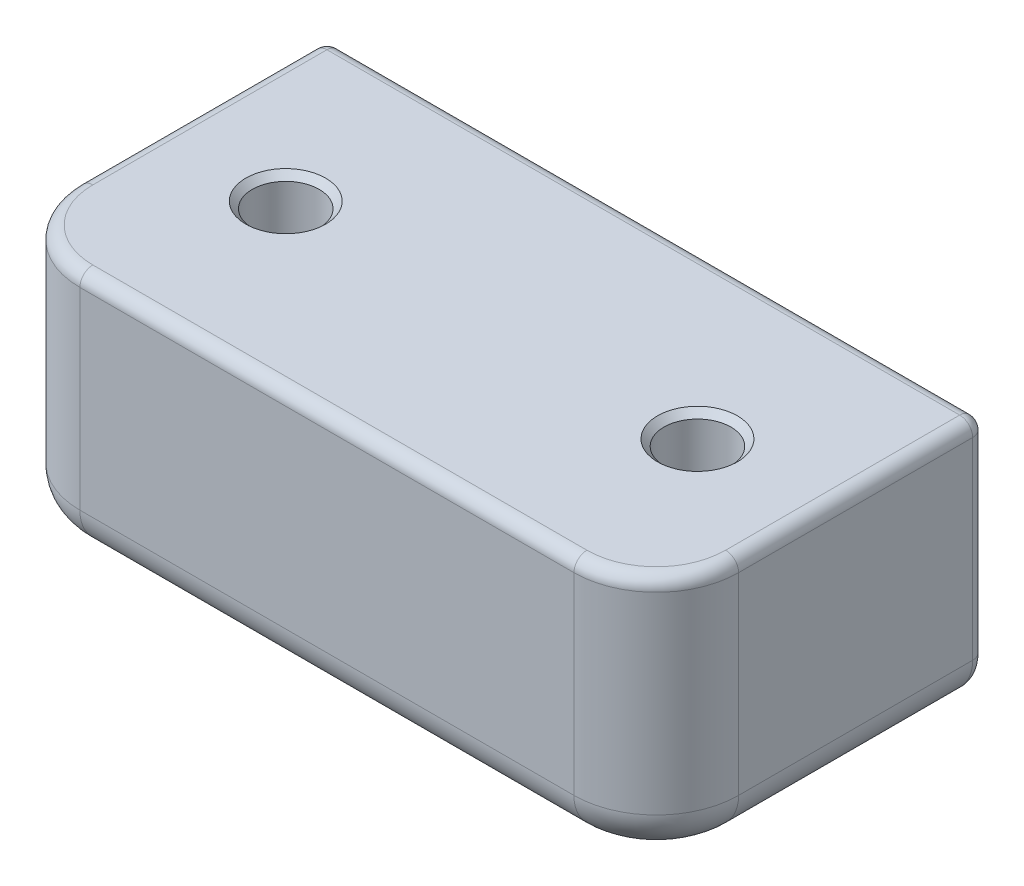
ISO-10303-21;
HEADER;
FILE_DESCRIPTION(('STEP AP214'),'2;1');
FILE_NAME('part.step','',(''),(''),'','','');
FILE_SCHEMA(('AUTOMOTIVE_DESIGN { 1 0 10303 214 1 1 1 1 }'));
ENDSEC;
DATA;
#1=APPLICATION_CONTEXT('core data for automotive mechanical design processes');
#2=APPLICATION_PROTOCOL_DEFINITION('international standard','automotive_design',2000,#1);
#3=PRODUCT_CONTEXT('',#1,'mechanical');
#4=PRODUCT('Part','Part','',(#3));
#5=PRODUCT_RELATED_PRODUCT_CATEGORY('part','',(#4));
#6=PRODUCT_DEFINITION_FORMATION('','',#4);
#7=PRODUCT_DEFINITION_CONTEXT('part definition',#1,'design');
#8=PRODUCT_DEFINITION('design','',#6,#7);
#9=PRODUCT_DEFINITION_SHAPE('','',#8);
#10=(LENGTH_UNIT() NAMED_UNIT(*) SI_UNIT(.MILLI.,.METRE.));
#11=(NAMED_UNIT(*) PLANE_ANGLE_UNIT() SI_UNIT($,.RADIAN.));
#12=(NAMED_UNIT(*) SI_UNIT($,.STERADIAN.) SOLID_ANGLE_UNIT());
#13=UNCERTAINTY_MEASURE_WITH_UNIT(LENGTH_MEASURE(1.E-05),#10,'distance_accuracy_value','');
#14=(GEOMETRIC_REPRESENTATION_CONTEXT(3) GLOBAL_UNCERTAINTY_ASSIGNED_CONTEXT((#13)) GLOBAL_UNIT_ASSIGNED_CONTEXT((#10,
#11,#12)) REPRESENTATION_CONTEXT('',''));
#15=CARTESIAN_POINT('',(0.,0.,0.));
#16=DIRECTION('',(0.,0.,1.));
#17=DIRECTION('',(1.,0.,0.));
#18=AXIS2_PLACEMENT_3D('',#15,#16,#17);
#19=CARTESIAN_POINT('',(50.8,19.05,-6.35000000000004));
#20=DIRECTION('',(-1.,0.,0.));
#21=DIRECTION('',(0.,0.,1.));
#22=AXIS2_PLACEMENT_3D('',#19,#20,#21);
#23=PLANE('',#22);
#24=DIRECTION('',(0.,-1.,0.));
#25=VECTOR('',#24,1.);
#26=CARTESIAN_POINT('',(50.8,19.05,-24.4));
#27=LINE('',#26,#25);
#28=CARTESIAN_POINT('',(50.8,3.175,-24.4));
#29=VERTEX_POINT('',#28);
#30=CARTESIAN_POINT('',(50.8,18.05,-24.4));
#31=VERTEX_POINT('',#30);
#32=EDGE_CURVE('E209',#29,#31,#27,.F.);
#33=ORIENTED_EDGE('',*,*,#32,.T.);
#34=DIRECTION('',(0.,0.,-1.));
#35=VECTOR('',#34,1.);
#36=CARTESIAN_POINT('',(50.8,18.05,-6.35000000000004));
#37=LINE('',#36,#35);
#38=CARTESIAN_POINT('',(50.8,18.05,-6.35000000000004));
#39=VERTEX_POINT('',#38);
#40=EDGE_CURVE('E211',#31,#39,#37,.F.);
#41=ORIENTED_EDGE('',*,*,#40,.T.);
#42=DIRECTION('',(0.,-1.,0.));
#43=VECTOR('',#42,1.);
#44=CARTESIAN_POINT('',(50.8,19.05,-6.35000000000004));
#45=LINE('',#44,#43);
#46=CARTESIAN_POINT('',(50.8,3.17500000000001,-6.35000000000004));
#47=VERTEX_POINT('',#46);
#48=EDGE_CURVE('E316',#39,#47,#45,.T.);
#49=ORIENTED_EDGE('',*,*,#48,.T.);
#50=DIRECTION('',(0.,0.,-1.));
#51=VECTOR('',#50,1.);
#52=CARTESIAN_POINT('',(50.8,3.175,-25.4));
#53=LINE('',#52,#51);
#54=EDGE_CURVE('E185',#47,#29,#53,.T.);
#55=ORIENTED_EDGE('',*,*,#54,.T.);
#56=EDGE_LOOP('',(#33,#41,#49,#55));
#57=FACE_BOUND('',#56,.T.);
#58=ADVANCED_FACE('F35',(#57),#23,.F.);
#59=CARTESIAN_POINT('',(0.,19.05,-25.4));
#60=DIRECTION('',(0.,0.,1.));
#61=DIRECTION('',(1.,0.,0.));
#62=AXIS2_PLACEMENT_3D('',#59,#60,#61);
#63=PLANE('',#62);
#64=DIRECTION('',(0.,-1.,0.));
#65=VECTOR('',#64,1.);
#66=CARTESIAN_POINT('',(49.8,19.05,-25.4));
#67=LINE('',#66,#65);
#68=CARTESIAN_POINT('',(49.8,18.05,-25.4));
#69=VERTEX_POINT('',#68);
#70=CARTESIAN_POINT('',(49.8,3.175,-25.4));
#71=VERTEX_POINT('',#70);
#72=EDGE_CURVE('E227',#69,#71,#67,.T.);
#73=ORIENTED_EDGE('',*,*,#72,.T.);
#74=CARTESIAN_POINT('',(47.625,3.175,-25.4));
#75=DIRECTION('',(0.,0.,1.));
#76=DIRECTION('',(1.,0.,0.));
#77=AXIS2_PLACEMENT_3D('',#74,#75,#76);
#78=CIRCLE('',#77,2.175);
#79=CARTESIAN_POINT('',(47.625,1.,-25.4));
#80=VERTEX_POINT('',#79);
#81=EDGE_CURVE('E229',#71,#80,#78,.F.);
#82=ORIENTED_EDGE('',*,*,#81,.T.);
#83=DIRECTION('',(-1.,0.,0.));
#84=VECTOR('',#83,1.);
#85=CARTESIAN_POINT('',(3.175,1.,-25.4));
#86=LINE('',#85,#84);
#87=CARTESIAN_POINT('',(3.175,1.,-25.4));
#88=VERTEX_POINT('',#87);
#89=EDGE_CURVE('E219',#80,#88,#86,.T.);
#90=ORIENTED_EDGE('',*,*,#89,.T.);
#91=CARTESIAN_POINT('',(3.175,3.175,-25.4));
#92=DIRECTION('',(0.,0.,1.));
#93=DIRECTION('',(1.,0.,0.));
#94=AXIS2_PLACEMENT_3D('',#91,#92,#93);
#95=CIRCLE('',#94,2.175);
#96=CARTESIAN_POINT('',(1.,3.175,-25.4));
#97=VERTEX_POINT('',#96);
#98=EDGE_CURVE('E221',#88,#97,#95,.F.);
#99=ORIENTED_EDGE('',*,*,#98,.T.);
#100=DIRECTION('',(0.,-1.,0.));
#101=VECTOR('',#100,1.);
#102=CARTESIAN_POINT('',(1.,19.05,-25.4));
#103=LINE('',#102,#101);
#104=CARTESIAN_POINT('',(1.,18.05,-25.4));
#105=VERTEX_POINT('',#104);
#106=EDGE_CURVE('E223',#97,#105,#103,.F.);
#107=ORIENTED_EDGE('',*,*,#106,.T.);
#108=DIRECTION('',(-1.,0.,0.));
#109=VECTOR('',#108,1.);
#110=CARTESIAN_POINT('',(0.,18.05,-25.4));
#111=LINE('',#110,#109);
#112=EDGE_CURVE('E225',#105,#69,#111,.F.);
#113=ORIENTED_EDGE('',*,*,#112,.T.);
#114=EDGE_LOOP('',(#73,#82,#90,#99,#107,#113));
#115=FACE_BOUND('',#114,.T.);
#116=CARTESIAN_POINT('',(9.525,9.52500000000001,-25.4));
#117=DIRECTION('',(0.,0.,1.));
#118=DIRECTION('',(1.,0.,0.));
#119=AXIS2_PLACEMENT_3D('',#116,#117,#118);
#120=CIRCLE('',#119,7.10400000000002);
#121=CARTESIAN_POINT('',(16.629,9.52500000000001,-25.4));
#122=VERTEX_POINT('',#121);
#123=EDGE_CURVE('E371',#122,#122,#120,.T.);
#124=ORIENTED_EDGE('',*,*,#123,.T.);
#125=EDGE_LOOP('',(#124));
#126=FACE_BOUND('',#125,.T.);
#127=CARTESIAN_POINT('',(41.275,9.525,-25.4));
#128=DIRECTION('',(0.,0.,1.));
#129=DIRECTION('',(1.,0.,0.));
#130=AXIS2_PLACEMENT_3D('',#127,#128,#129);
#131=CIRCLE('',#130,7.10400000000003);
#132=CARTESIAN_POINT('',(48.379,9.525,-25.4));
#133=VERTEX_POINT('',#132);
#134=EDGE_CURVE('E374',#133,#133,#131,.T.);
#135=ORIENTED_EDGE('',*,*,#134,.T.);
#136=EDGE_LOOP('',(#135));
#137=FACE_BOUND('',#136,.T.);
#138=ADVANCED_FACE('F364',(#115,#126,#137),#63,.F.);
#139=CARTESIAN_POINT('',(0.,19.05,-6.35000000000004));
#140=DIRECTION('',(1.,0.,0.));
#141=DIRECTION('',(0.,0.,-1.));
#142=AXIS2_PLACEMENT_3D('',#139,#140,#141);
#143=PLANE('',#142);
#144=DIRECTION('',(0.,0.,1.));
#145=VECTOR('',#144,1.);
#146=CARTESIAN_POINT('',(0.,18.05,-6.35000000000004));
#147=LINE('',#146,#145);
#148=CARTESIAN_POINT('',(0.,18.05,-6.35000000000004));
#149=VERTEX_POINT('',#148);
#150=CARTESIAN_POINT('',(0.,18.05,-24.4));
#151=VERTEX_POINT('',#150);
#152=EDGE_CURVE('E59',#149,#151,#147,.F.);
#153=ORIENTED_EDGE('',*,*,#152,.T.);
#154=DIRECTION('',(0.,-1.,0.));
#155=VECTOR('',#154,1.);
#156=CARTESIAN_POINT('',(0.,19.05,-24.4));
#157=LINE('',#156,#155);
#158=CARTESIAN_POINT('',(0.,3.175,-24.4));
#159=VERTEX_POINT('',#158);
#160=EDGE_CURVE('E146',#151,#159,#157,.T.);
#161=ORIENTED_EDGE('',*,*,#160,.T.);
#162=DIRECTION('',(0.,0.,1.));
#163=VECTOR('',#162,1.);
#164=CARTESIAN_POINT('',(0.,3.175,-6.35000000000004));
#165=LINE('',#164,#163);
#166=CARTESIAN_POINT('',(0.,3.175,-6.35000000000004));
#167=VERTEX_POINT('',#166);
#168=EDGE_CURVE('E142',#159,#167,#165,.T.);
#169=ORIENTED_EDGE('',*,*,#168,.T.);
#170=DIRECTION('',(0.,-1.,0.));
#171=VECTOR('',#170,1.);
#172=CARTESIAN_POINT('',(0.,19.05,-6.35000000000004));
#173=LINE('',#172,#171);
#174=EDGE_CURVE('E145',#149,#167,#173,.T.);
#175=ORIENTED_EDGE('',*,*,#174,.F.);
#176=EDGE_LOOP('',(#153,#161,#169,#175));
#177=FACE_BOUND('',#176,.T.);
#178=ADVANCED_FACE('F144',(#177),#143,.F.);
#179=CARTESIAN_POINT('',(6.35,19.05,-6.35));
#180=DIRECTION('',(0.,-1.,0.));
#181=DIRECTION('',(0.,0.,-1.));
#182=AXIS2_PLACEMENT_3D('',#179,#180,#181);
#183=CYLINDRICAL_SURFACE('',#182,6.35);
#184=DIRECTION('',(0.,-1.,0.));
#185=VECTOR('',#184,1.);
#186=CARTESIAN_POINT('',(6.35000000000005,19.05,0.));
#187=LINE('',#186,#185);
#188=CARTESIAN_POINT('',(6.35000000000005,18.05,0.));
#189=VERTEX_POINT('',#188);
#190=CARTESIAN_POINT('',(6.35000000000005,3.17500000000001,0.));
#191=VERTEX_POINT('',#190);
#192=EDGE_CURVE('E161',#189,#191,#187,.T.);
#193=ORIENTED_EDGE('',*,*,#192,.F.);
#194=CARTESIAN_POINT('',(6.35,18.05,-6.35));
#195=DIRECTION('',(0.,-1.,0.));
#196=DIRECTION('',(0.,0.,-1.));
#197=AXIS2_PLACEMENT_3D('',#194,#195,#196);
#198=CIRCLE('',#197,6.35);
#199=EDGE_CURVE('E159',#189,#149,#198,.T.);
#200=ORIENTED_EDGE('',*,*,#199,.T.);
#201=ORIENTED_EDGE('',*,*,#174,.T.);
#202=CARTESIAN_POINT('',(6.35,3.17499999999999,-6.35));
#203=DIRECTION('',(0.,-1.,0.));
#204=DIRECTION('',(0.,0.,-1.));
#205=AXIS2_PLACEMENT_3D('',#202,#203,#204);
#206=CIRCLE('',#205,6.35);
#207=EDGE_CURVE('E156',#167,#191,#206,.F.);
#208=ORIENTED_EDGE('',*,*,#207,.T.);
#209=EDGE_LOOP('',(#193,#200,#201,#208));
#210=FACE_BOUND('',#209,.T.);
#211=ADVANCED_FACE('F154',(#210),#183,.T.);
#212=CARTESIAN_POINT('',(6.35000000000004,19.05,0.));
#213=DIRECTION('',(0.,0.,-1.));
#214=DIRECTION('',(-1.,0.,0.));
#215=AXIS2_PLACEMENT_3D('',#212,#213,#214);
#216=PLANE('',#215);
#217=DIRECTION('',(0.,-1.,0.));
#218=VECTOR('',#217,1.);
#219=CARTESIAN_POINT('',(44.45,19.05,0.));
#220=LINE('',#219,#218);
#221=CARTESIAN_POINT('',(44.45,18.05,0.));
#222=VERTEX_POINT('',#221);
#223=CARTESIAN_POINT('',(44.45,3.175,0.));
#224=VERTEX_POINT('',#223);
#225=EDGE_CURVE('E309',#222,#224,#220,.T.);
#226=ORIENTED_EDGE('',*,*,#225,.F.);
#227=DIRECTION('',(1.,0.,0.));
#228=VECTOR('',#227,1.);
#229=CARTESIAN_POINT('',(6.35000000000004,18.05,0.));
#230=LINE('',#229,#228);
#231=EDGE_CURVE('E216',#222,#189,#230,.F.);
#232=ORIENTED_EDGE('',*,*,#231,.T.);
#233=ORIENTED_EDGE('',*,*,#192,.T.);
#234=DIRECTION('',(1.,0.,0.));
#235=VECTOR('',#234,1.);
#236=CARTESIAN_POINT('',(44.45,3.175,0.));
#237=LINE('',#236,#235);
#238=EDGE_CURVE('E174',#191,#224,#237,.T.);
#239=ORIENTED_EDGE('',*,*,#238,.T.);
#240=EDGE_LOOP('',(#226,#232,#233,#239));
#241=FACE_BOUND('',#240,.T.);
#242=ADVANCED_FACE('F308',(#241),#216,.F.);
#243=CARTESIAN_POINT('',(44.45,19.05,-6.35));
#244=DIRECTION('',(0.,-1.,0.));
#245=DIRECTION('',(0.,0.,-1.));
#246=AXIS2_PLACEMENT_3D('',#243,#244,#245);
#247=CYLINDRICAL_SURFACE('',#246,6.35);
#248=ORIENTED_EDGE('',*,*,#48,.F.);
#249=CARTESIAN_POINT('',(44.45,18.05,-6.35));
#250=DIRECTION('',(0.,-1.,0.));
#251=DIRECTION('',(0.,0.,-1.));
#252=AXIS2_PLACEMENT_3D('',#249,#250,#251);
#253=CIRCLE('',#252,6.35);
#254=EDGE_CURVE('E214',#39,#222,#253,.T.);
#255=ORIENTED_EDGE('',*,*,#254,.T.);
#256=ORIENTED_EDGE('',*,*,#225,.T.);
#257=CARTESIAN_POINT('',(44.45,3.17499999999999,-6.35));
#258=DIRECTION('',(0.,-1.,0.));
#259=DIRECTION('',(0.,0.,-1.));
#260=AXIS2_PLACEMENT_3D('',#257,#258,#259);
#261=CIRCLE('',#260,6.35);
#262=EDGE_CURVE('E177',#224,#47,#261,.F.);
#263=ORIENTED_EDGE('',*,*,#262,.T.);
#264=EDGE_LOOP('',(#248,#255,#256,#263));
#265=FACE_BOUND('',#264,.T.);
#266=ADVANCED_FACE('F315',(#265),#247,.T.);
#267=CARTESIAN_POINT('',(6.35,19.05,-6.35));
#268=DIRECTION('',(0.,-1.,0.));
#269=DIRECTION('',(0.,0.,-1.));
#270=AXIS2_PLACEMENT_3D('',#267,#268,#269);
#271=PLANE('',#270);
#272=CARTESIAN_POINT('',(44.45,19.05,-6.35));
#273=DIRECTION('',(0.,-1.,0.));
#274=DIRECTION('',(0.,0.,-1.));
#275=AXIS2_PLACEMENT_3D('',#272,#273,#274);
#276=CIRCLE('',#275,5.35);
#277=CARTESIAN_POINT('',(44.45,19.05,-1.));
#278=VERTEX_POINT('',#277);
#279=CARTESIAN_POINT('',(49.8,19.05,-6.35000000000004));
#280=VERTEX_POINT('',#279);
#281=EDGE_CURVE('E204',#278,#280,#276,.F.);
#282=ORIENTED_EDGE('',*,*,#281,.T.);
#283=DIRECTION('',(0.,0.,-1.));
#284=VECTOR('',#283,1.);
#285=CARTESIAN_POINT('',(49.8,19.05,-6.35));
#286=LINE('',#285,#284);
#287=CARTESIAN_POINT('',(49.8,19.05,-24.4));
#288=VERTEX_POINT('',#287);
#289=EDGE_CURVE('E206',#280,#288,#286,.T.);
#290=ORIENTED_EDGE('',*,*,#289,.T.);
#291=DIRECTION('',(-1.,0.,0.));
#292=VECTOR('',#291,1.);
#293=CARTESIAN_POINT('',(6.35,19.05,-24.4));
#294=LINE('',#293,#292);
#295=CARTESIAN_POINT('',(1.,19.05,-24.4));
#296=VERTEX_POINT('',#295);
#297=EDGE_CURVE('E198',#288,#296,#294,.T.);
#298=ORIENTED_EDGE('',*,*,#297,.T.);
#299=DIRECTION('',(0.,0.,1.));
#300=VECTOR('',#299,1.);
#301=CARTESIAN_POINT('',(1.,19.05,-6.35));
#302=LINE('',#301,#300);
#303=CARTESIAN_POINT('',(1.,19.05,-6.35000000000004));
#304=VERTEX_POINT('',#303);
#305=EDGE_CURVE('E187',#296,#304,#302,.T.);
#306=ORIENTED_EDGE('',*,*,#305,.T.);
#307=CARTESIAN_POINT('',(6.35,19.05,-6.35));
#308=DIRECTION('',(0.,-1.,0.));
#309=DIRECTION('',(0.,0.,-1.));
#310=AXIS2_PLACEMENT_3D('',#307,#308,#309);
#311=CIRCLE('',#310,5.35);
#312=CARTESIAN_POINT('',(6.35000000000005,19.05,-1.));
#313=VERTEX_POINT('',#312);
#314=EDGE_CURVE('E200',#304,#313,#311,.F.);
#315=ORIENTED_EDGE('',*,*,#314,.T.);
#316=DIRECTION('',(1.,0.,0.));
#317=VECTOR('',#316,1.);
#318=CARTESIAN_POINT('',(6.35,19.05,-1.));
#319=LINE('',#318,#317);
#320=EDGE_CURVE('E202',#313,#278,#319,.T.);
#321=ORIENTED_EDGE('',*,*,#320,.T.);
#322=EDGE_LOOP('',(#282,#290,#298,#306,#315,#321));
#323=FACE_BOUND('',#322,.T.);
#324=CARTESIAN_POINT('',(9.525,19.05,-12.7));
#325=DIRECTION('',(0.,-1.,0.));
#326=DIRECTION('',(0.,0.,-1.));
#327=AXIS2_PLACEMENT_3D('',#324,#325,#326);
#328=CIRCLE('',#327,3.07968750000005);
#329=CARTESIAN_POINT('',(9.525,19.05,-15.7796875000001));
#330=VERTEX_POINT('',#329);
#331=EDGE_CURVE('E435',#330,#330,#328,.T.);
#332=ORIENTED_EDGE('',*,*,#331,.T.);
#333=EDGE_LOOP('',(#332));
#334=FACE_BOUND('',#333,.T.);
#335=CARTESIAN_POINT('',(41.275,19.05,-12.7));
#336=DIRECTION('',(0.,-1.,0.));
#337=DIRECTION('',(0.,0.,-1.));
#338=AXIS2_PLACEMENT_3D('',#335,#336,#337);
#339=CIRCLE('',#338,3.07968750000005);
#340=CARTESIAN_POINT('',(41.275,19.05,-15.7796875000001));
#341=VERTEX_POINT('',#340);
#342=EDGE_CURVE('E440',#341,#341,#339,.T.);
#343=ORIENTED_EDGE('',*,*,#342,.T.);
#344=EDGE_LOOP('',(#343));
#345=FACE_BOUND('',#344,.T.);
#346=ADVANCED_FACE('F344',(#323,#334,#345),#271,.F.);
#347=CARTESIAN_POINT('',(6.35,0.,-6.35));
#348=DIRECTION('',(0.,-1.,0.));
#349=DIRECTION('',(0.,0.,-1.));
#350=AXIS2_PLACEMENT_3D('',#347,#348,#349);
#351=PLANE('',#350);
#352=CARTESIAN_POINT('',(9.525,0.,-12.7));
#353=DIRECTION('',(0.,-1.,0.));
#354=DIRECTION('',(0.,0.,-1.));
#355=AXIS2_PLACEMENT_3D('',#352,#353,#354);
#356=CIRCLE('',#355,3.07968749999997);
#357=CARTESIAN_POINT('',(9.525,0.,-15.7796875));
#358=VERTEX_POINT('',#357);
#359=EDGE_CURVE('E434',#358,#358,#356,.F.);
#360=ORIENTED_EDGE('',*,*,#359,.T.);
#361=EDGE_LOOP('',(#360));
#362=FACE_BOUND('',#361,.T.);
#363=CARTESIAN_POINT('',(41.275,0.,-12.7));
#364=DIRECTION('',(0.,-1.,0.));
#365=DIRECTION('',(0.,0.,-1.));
#366=AXIS2_PLACEMENT_3D('',#363,#364,#365);
#367=CIRCLE('',#366,3.07968749999998);
#368=CARTESIAN_POINT('',(41.275,0.,-15.7796875));
#369=VERTEX_POINT('',#368);
#370=EDGE_CURVE('E432',#369,#369,#367,.F.);
#371=ORIENTED_EDGE('',*,*,#370,.T.);
#372=EDGE_LOOP('',(#371));
#373=FACE_BOUND('',#372,.T.);
#374=DIRECTION('',(0.,0.,1.));
#375=VECTOR('',#374,1.);
#376=CARTESIAN_POINT('',(3.175,0.,-25.4));
#377=LINE('',#376,#375);
#378=CARTESIAN_POINT('',(3.175,0.,-6.35000000000004));
#379=VERTEX_POINT('',#378);
#380=CARTESIAN_POINT('',(3.175,0.,-24.4));
#381=VERTEX_POINT('',#380);
#382=EDGE_CURVE('E166',#379,#381,#377,.F.);
#383=ORIENTED_EDGE('',*,*,#382,.T.);
#384=DIRECTION('',(-1.,0.,0.));
#385=VECTOR('',#384,1.);
#386=CARTESIAN_POINT('',(47.625,0.,-24.4));
#387=LINE('',#386,#385);
#388=CARTESIAN_POINT('',(47.625,0.,-24.4));
#389=VERTEX_POINT('',#388);
#390=EDGE_CURVE('E11',#381,#389,#387,.F.);
#391=ORIENTED_EDGE('',*,*,#390,.T.);
#392=DIRECTION('',(0.,0.,-1.));
#393=VECTOR('',#392,1.);
#394=CARTESIAN_POINT('',(47.625,0.,-6.35000000000004));
#395=LINE('',#394,#393);
#396=CARTESIAN_POINT('',(47.625,0.,-6.35000000000002));
#397=VERTEX_POINT('',#396);
#398=EDGE_CURVE('E148',#389,#397,#395,.F.);
#399=ORIENTED_EDGE('',*,*,#398,.T.);
#400=CARTESIAN_POINT('',(44.45,0.,-6.35));
#401=DIRECTION('',(0.,-1.,0.));
#402=DIRECTION('',(0.,0.,-1.));
#403=AXIS2_PLACEMENT_3D('',#400,#401,#402);
#404=CIRCLE('',#403,3.175);
#405=CARTESIAN_POINT('',(44.45,0.,-3.175));
#406=VERTEX_POINT('',#405);
#407=EDGE_CURVE('E295',#397,#406,#404,.T.);
#408=ORIENTED_EDGE('',*,*,#407,.T.);
#409=DIRECTION('',(1.,0.,0.));
#410=VECTOR('',#409,1.);
#411=CARTESIAN_POINT('',(6.35000000000005,0.,-3.175));
#412=LINE('',#411,#410);
#413=CARTESIAN_POINT('',(6.35000000000002,0.,-3.175));
#414=VERTEX_POINT('',#413);
#415=EDGE_CURVE('E297',#406,#414,#412,.F.);
#416=ORIENTED_EDGE('',*,*,#415,.T.);
#417=CARTESIAN_POINT('',(6.35,0.,-6.35));
#418=DIRECTION('',(0.,-1.,0.));
#419=DIRECTION('',(0.,0.,-1.));
#420=AXIS2_PLACEMENT_3D('',#417,#418,#419);
#421=CIRCLE('',#420,3.175);
#422=EDGE_CURVE('E179',#414,#379,#421,.T.);
#423=ORIENTED_EDGE('',*,*,#422,.T.);
#424=EDGE_LOOP('',(#383,#391,#399,#408,#416,#423));
#425=FACE_BOUND('',#424,.T.);
#426=ADVANCED_FACE('F289',(#362,#373,#425),#351,.T.);
#427=CARTESIAN_POINT('',(9.525,0.,-12.7));
#428=DIRECTION('',(0.,1.,0.));
#429=DIRECTION('',(0.,0.,1.));
#430=AXIS2_PLACEMENT_3D('',#427,#428,#429);
#431=CYLINDRICAL_SURFACE('',#430,2.5796875);
#432=CARTESIAN_POINT('',(9.525,18.55,-12.7));
#433=DIRECTION('',(0.,-1.,0.));
#434=DIRECTION('',(0.,0.,-1.));
#435=AXIS2_PLACEMENT_3D('',#432,#433,#434);
#436=CIRCLE('',#435,2.5796875);
#437=CARTESIAN_POINT('',(9.525,18.55,-15.2796875));
#438=VERTEX_POINT('',#437);
#439=EDGE_CURVE('E722',#438,#438,#436,.F.);
#440=ORIENTED_EDGE('',*,*,#439,.T.);
#441=EDGE_LOOP('',(#440));
#442=FACE_BOUND('',#441,.T.);
#443=CARTESIAN_POINT('',(9.525,0.499999999999974,-12.7));
#444=DIRECTION('',(0.,-1.,0.));
#445=DIRECTION('',(0.,0.,-1.));
#446=AXIS2_PLACEMENT_3D('',#443,#444,#445);
#447=CIRCLE('',#446,2.5796875);
#448=CARTESIAN_POINT('',(9.525,0.499999999999974,-15.2796875));
#449=VERTEX_POINT('',#448);
#450=EDGE_CURVE('E160',#449,#449,#447,.T.);
#451=ORIENTED_EDGE('',*,*,#450,.T.);
#452=EDGE_LOOP('',(#451));
#453=FACE_BOUND('',#452,.T.);
#454=ADVANCED_FACE('F451',(#442,#453),#431,.F.);
#455=CARTESIAN_POINT('',(41.275,0.,-12.7));
#456=DIRECTION('',(0.,1.,0.));
#457=DIRECTION('',(0.,0.,1.));
#458=AXIS2_PLACEMENT_3D('',#455,#456,#457);
#459=CYLINDRICAL_SURFACE('',#458,2.5796875);
#460=CARTESIAN_POINT('',(41.275,18.55,-12.7));
#461=DIRECTION('',(0.,-1.,0.));
#462=DIRECTION('',(0.,0.,-1.));
#463=AXIS2_PLACEMENT_3D('',#460,#461,#462);
#464=CIRCLE('',#463,2.5796875);
#465=CARTESIAN_POINT('',(41.275,18.55,-15.2796875));
#466=VERTEX_POINT('',#465);
#467=EDGE_CURVE('E380',#466,#466,#464,.F.);
#468=ORIENTED_EDGE('',*,*,#467,.T.);
#469=EDGE_LOOP('',(#468));
#470=FACE_BOUND('',#469,.T.);
#471=CARTESIAN_POINT('',(41.275,0.499999999999977,-12.7));
#472=DIRECTION('',(0.,-1.,0.));
#473=DIRECTION('',(0.,0.,-1.));
#474=AXIS2_PLACEMENT_3D('',#471,#472,#473);
#475=CIRCLE('',#474,2.5796875);
#476=CARTESIAN_POINT('',(41.275,0.499999999999977,-15.2796875));
#477=VERTEX_POINT('',#476);
#478=EDGE_CURVE('E429',#477,#477,#475,.T.);
#479=ORIENTED_EDGE('',*,*,#478,.T.);
#480=EDGE_LOOP('',(#479));
#481=FACE_BOUND('',#480,.T.);
#482=ADVANCED_FACE('F447',(#470,#481),#459,.F.);
#483=CARTESIAN_POINT('',(41.275,9.525,-18.796));
#484=DIRECTION('',(0.,0.,-1.));
#485=DIRECTION('',(-1.,0.,0.));
#486=AXIS2_PLACEMENT_3D('',#483,#484,#485);
#487=CYLINDRICAL_SURFACE('',#486,6.604);
#488=CARTESIAN_POINT('',(41.275,9.525,-24.9));
#489=DIRECTION('',(0.,0.,1.));
#490=DIRECTION('',(1.,0.,0.));
#491=AXIS2_PLACEMENT_3D('',#488,#489,#490);
#492=CIRCLE('',#491,6.604);
#493=CARTESIAN_POINT('',(47.879,9.525,-24.9));
#494=VERTEX_POINT('',#493);
#495=EDGE_CURVE('E149',#494,#494,#492,.F.);
#496=ORIENTED_EDGE('',*,*,#495,.T.);
#497=EDGE_LOOP('',(#496));
#498=FACE_BOUND('',#497,.T.);
#499=CARTESIAN_POINT('',(41.275,9.525,-18.796));
#500=DIRECTION('',(0.,0.,-1.));
#501=DIRECTION('',(-1.,0.,0.));
#502=AXIS2_PLACEMENT_3D('',#499,#500,#501);
#503=CIRCLE('',#502,6.604);
#504=CARTESIAN_POINT('',(34.671,9.525,-18.796));
#505=VERTEX_POINT('',#504);
#506=EDGE_CURVE('E713',#505,#505,#503,.T.);
#507=ORIENTED_EDGE('',*,*,#506,.F.);
#508=EDGE_LOOP('',(#507));
#509=FACE_BOUND('',#508,.T.);
#510=ADVANCED_FACE('F386',(#498,#509),#487,.F.);
#511=CARTESIAN_POINT('',(41.275,9.525,-18.796));
#512=DIRECTION('',(0.,0.,-1.));
#513=DIRECTION('',(-1.,0.,0.));
#514=AXIS2_PLACEMENT_3D('',#511,#512,#513);
#515=PLANE('',#514);
#516=ORIENTED_EDGE('',*,*,#506,.T.);
#517=EDGE_LOOP('',(#516));
#518=FACE_BOUND('',#517,.T.);
#519=ADVANCED_FACE('F457',(#518),#515,.T.);
#520=CARTESIAN_POINT('',(9.525,9.52500000000001,-18.796));
#521=DIRECTION('',(0.,0.,-1.));
#522=DIRECTION('',(-1.,0.,0.));
#523=AXIS2_PLACEMENT_3D('',#520,#521,#522);
#524=CYLINDRICAL_SURFACE('',#523,6.604);
#525=CARTESIAN_POINT('',(9.525,9.52500000000001,-24.9));
#526=DIRECTION('',(0.,0.,1.));
#527=DIRECTION('',(1.,0.,0.));
#528=AXIS2_PLACEMENT_3D('',#525,#526,#527);
#529=CIRCLE('',#528,6.604);
#530=CARTESIAN_POINT('',(16.129,9.52500000000001,-24.9));
#531=VERTEX_POINT('',#530);
#532=EDGE_CURVE('E376',#531,#531,#529,.F.);
#533=ORIENTED_EDGE('',*,*,#532,.T.);
#534=EDGE_LOOP('',(#533));
#535=FACE_BOUND('',#534,.T.);
#536=CARTESIAN_POINT('',(9.525,9.52500000000001,-18.796));
#537=DIRECTION('',(0.,0.,-1.));
#538=DIRECTION('',(1.,0.,0.));
#539=AXIS2_PLACEMENT_3D('',#536,#537,#538);
#540=CIRCLE('',#539,6.604);
#541=CARTESIAN_POINT('',(16.129,9.52500000000001,-18.796));
#542=VERTEX_POINT('',#541);
#543=EDGE_CURVE('E196',#542,#542,#540,.T.);
#544=ORIENTED_EDGE('',*,*,#543,.F.);
#545=EDGE_LOOP('',(#544));
#546=FACE_BOUND('',#545,.T.);
#547=ADVANCED_FACE('F671',(#535,#546),#524,.F.);
#548=CARTESIAN_POINT('',(9.525,9.52500000000001,-18.796));
#549=DIRECTION('',(0.,0.,1.));
#550=DIRECTION('',(1.,0.,0.));
#551=AXIS2_PLACEMENT_3D('',#548,#549,#550);
#552=PLANE('',#551);
#553=ORIENTED_EDGE('',*,*,#543,.T.);
#554=EDGE_LOOP('',(#553));
#555=FACE_BOUND('',#554,.T.);
#556=ADVANCED_FACE('F413',(#555),#552,.F.);
#557=CARTESIAN_POINT('',(9.525,18.55,-12.7));
#558=DIRECTION('',(0.,1.,0.));
#559=DIRECTION('',(0.,0.,1.));
#560=AXIS2_PLACEMENT_3D('',#557,#558,#559);
#561=CONICAL_SURFACE('',#560,2.5796875,0.785398163397455);
#562=ORIENTED_EDGE('',*,*,#331,.F.);
#563=EDGE_LOOP('',(#562));
#564=FACE_BOUND('',#563,.T.);
#565=ORIENTED_EDGE('',*,*,#439,.F.);
#566=EDGE_LOOP('',(#565));
#567=FACE_BOUND('',#566,.T.);
#568=ADVANCED_FACE('F409',(#564,#567),#561,.F.);
#569=CARTESIAN_POINT('',(9.525,0.,-12.7));
#570=DIRECTION('',(0.,-1.,0.));
#571=DIRECTION('',(0.,0.,-1.));
#572=AXIS2_PLACEMENT_3D('',#569,#570,#571);
#573=CONICAL_SURFACE('',#572,3.07968749999997,0.785398163397444);
#574=ORIENTED_EDGE('',*,*,#450,.F.);
#575=EDGE_LOOP('',(#574));
#576=FACE_BOUND('',#575,.T.);
#577=ORIENTED_EDGE('',*,*,#359,.F.);
#578=EDGE_LOOP('',(#577));
#579=FACE_BOUND('',#578,.T.);
#580=ADVANCED_FACE('F412',(#576,#579),#573,.F.);
#581=CARTESIAN_POINT('',(41.275,18.55,-12.7));
#582=DIRECTION('',(0.,1.,0.));
#583=DIRECTION('',(0.,0.,1.));
#584=AXIS2_PLACEMENT_3D('',#581,#582,#583);
#585=CONICAL_SURFACE('',#584,2.5796875,0.785398163397456);
#586=ORIENTED_EDGE('',*,*,#342,.F.);
#587=EDGE_LOOP('',(#586));
#588=FACE_BOUND('',#587,.T.);
#589=ORIENTED_EDGE('',*,*,#467,.F.);
#590=EDGE_LOOP('',(#589));
#591=FACE_BOUND('',#590,.T.);
#592=ADVANCED_FACE('F417',(#588,#591),#585,.F.);
#593=CARTESIAN_POINT('',(41.275,0.,-12.7));
#594=DIRECTION('',(0.,-1.,0.));
#595=DIRECTION('',(0.,0.,-1.));
#596=AXIS2_PLACEMENT_3D('',#593,#594,#595);
#597=CONICAL_SURFACE('',#596,3.07968749999998,0.785398163397451);
#598=ORIENTED_EDGE('',*,*,#478,.F.);
#599=EDGE_LOOP('',(#598));
#600=FACE_BOUND('',#599,.T.);
#601=ORIENTED_EDGE('',*,*,#370,.F.);
#602=EDGE_LOOP('',(#601));
#603=FACE_BOUND('',#602,.T.);
#604=ADVANCED_FACE('F398',(#600,#603),#597,.F.);
#605=CARTESIAN_POINT('',(9.525,9.52500000000001,-24.9));
#606=DIRECTION('',(0.,0.,-1.));
#607=DIRECTION('',(-1.,0.,0.));
#608=AXIS2_PLACEMENT_3D('',#605,#606,#607);
#609=CONICAL_SURFACE('',#608,6.604,0.785398163397456);
#610=ORIENTED_EDGE('',*,*,#123,.F.);
#611=EDGE_LOOP('',(#610));
#612=FACE_BOUND('',#611,.T.);
#613=ORIENTED_EDGE('',*,*,#532,.F.);
#614=EDGE_LOOP('',(#613));
#615=FACE_BOUND('',#614,.T.);
#616=ADVANCED_FACE('F391',(#612,#615),#609,.F.);
#617=CARTESIAN_POINT('',(41.275,9.525,-24.9));
#618=DIRECTION('',(0.,0.,-1.));
#619=DIRECTION('',(-1.,0.,0.));
#620=AXIS2_PLACEMENT_3D('',#617,#618,#619);
#621=CONICAL_SURFACE('',#620,6.604,0.78539816339745);
#622=ORIENTED_EDGE('',*,*,#134,.F.);
#623=EDGE_LOOP('',(#622));
#624=FACE_BOUND('',#623,.T.);
#625=ORIENTED_EDGE('',*,*,#495,.F.);
#626=EDGE_LOOP('',(#625));
#627=FACE_BOUND('',#626,.T.);
#628=ADVANCED_FACE('F389',(#624,#627),#621,.F.);
#629=CARTESIAN_POINT('',(47.625,3.175,-6.35000000000004));
#630=DIRECTION('',(0.,0.,1.));
#631=DIRECTION('',(1.,0.,0.));
#632=AXIS2_PLACEMENT_3D('',#629,#630,#631);
#633=CYLINDRICAL_SURFACE('',#632,3.175);
#634=ORIENTED_EDGE('',*,*,#398,.F.);
#635=CARTESIAN_POINT('',(47.625,3.175,-24.4));
#636=DIRECTION('',(0.,0.,1.));
#637=DIRECTION('',(1.,0.,0.));
#638=AXIS2_PLACEMENT_3D('',#635,#636,#637);
#639=CIRCLE('',#638,3.175);
#640=EDGE_CURVE('E232',#389,#29,#639,.T.);
#641=ORIENTED_EDGE('',*,*,#640,.T.);
#642=ORIENTED_EDGE('',*,*,#54,.F.);
#643=CARTESIAN_POINT('',(47.625,3.175,-6.35000000000002));
#644=DIRECTION('',(0.,0.,1.));
#645=DIRECTION('',(1.,0.,0.));
#646=AXIS2_PLACEMENT_3D('',#643,#644,#645);
#647=CIRCLE('',#646,3.175);
#648=EDGE_CURVE('E193',#397,#47,#647,.T.);
#649=ORIENTED_EDGE('',*,*,#648,.F.);
#650=EDGE_LOOP('',(#634,#641,#642,#649));
#651=FACE_BOUND('',#650,.T.);
#652=ADVANCED_FACE('F292',(#651),#633,.T.);
#653=CARTESIAN_POINT('',(44.45,3.175,-6.35));
#654=DIRECTION('',(0.,-1.,0.));
#655=DIRECTION('',(0.,0.,-1.));
#656=AXIS2_PLACEMENT_3D('',#653,#654,#655);
#657=TOROIDAL_SURFACE('',#656,3.175,3.175);
#658=ORIENTED_EDGE('',*,*,#648,.T.);
#659=ORIENTED_EDGE('',*,*,#262,.F.);
#660=CARTESIAN_POINT('',(44.45,3.175,-3.175));
#661=DIRECTION('',(-1.,0.,0.));
#662=DIRECTION('',(0.,0.,1.));
#663=AXIS2_PLACEMENT_3D('',#660,#661,#662);
#664=CIRCLE('',#663,3.175);
#665=EDGE_CURVE('E190',#406,#224,#664,.T.);
#666=ORIENTED_EDGE('',*,*,#665,.F.);
#667=ORIENTED_EDGE('',*,*,#407,.F.);
#668=EDGE_LOOP('',(#658,#659,#666,#667));
#669=FACE_BOUND('',#668,.T.);
#670=ADVANCED_FACE('F312',(#669),#657,.T.);
#671=CARTESIAN_POINT('',(6.35000000000004,3.175,-3.175));
#672=DIRECTION('',(-1.,0.,0.));
#673=DIRECTION('',(0.,0.,1.));
#674=AXIS2_PLACEMENT_3D('',#671,#672,#673);
#675=CYLINDRICAL_SURFACE('',#674,3.175);
#676=ORIENTED_EDGE('',*,*,#665,.T.);
#677=ORIENTED_EDGE('',*,*,#238,.F.);
#678=CARTESIAN_POINT('',(6.35000000000002,3.175,-3.175));
#679=DIRECTION('',(-1.,0.,0.));
#680=DIRECTION('',(0.,0.,1.));
#681=AXIS2_PLACEMENT_3D('',#678,#679,#680);
#682=CIRCLE('',#681,3.175);
#683=EDGE_CURVE('E169',#414,#191,#682,.T.);
#684=ORIENTED_EDGE('',*,*,#683,.F.);
#685=ORIENTED_EDGE('',*,*,#415,.F.);
#686=EDGE_LOOP('',(#676,#677,#684,#685));
#687=FACE_BOUND('',#686,.T.);
#688=ADVANCED_FACE('F304',(#687),#675,.T.);
#689=CARTESIAN_POINT('',(6.35,3.175,-6.35));
#690=DIRECTION('',(0.,-1.,0.));
#691=DIRECTION('',(0.,0.,-1.));
#692=AXIS2_PLACEMENT_3D('',#689,#690,#691);
#693=DEGENERATE_TOROIDAL_SURFACE('',#692,3.175,3.175,.T.);
#694=ORIENTED_EDGE('',*,*,#683,.T.);
#695=ORIENTED_EDGE('',*,*,#207,.F.);
#696=CARTESIAN_POINT('',(3.175,3.175,-6.35000000000004));
#697=DIRECTION('',(0.,0.,-1.));
#698=DIRECTION('',(-1.,0.,0.));
#699=AXIS2_PLACEMENT_3D('',#696,#697,#698);
#700=CIRCLE('',#699,3.175);
#701=EDGE_CURVE('E164',#379,#167,#700,.T.);
#702=ORIENTED_EDGE('',*,*,#701,.F.);
#703=ORIENTED_EDGE('',*,*,#422,.F.);
#704=EDGE_LOOP('',(#694,#695,#702,#703));
#705=FACE_BOUND('',#704,.T.);
#706=ADVANCED_FACE('F172',(#705),#693,.T.);
#707=CARTESIAN_POINT('',(3.175,3.175,-6.35000000000004));
#708=DIRECTION('',(0.,0.,-1.));
#709=DIRECTION('',(-1.,0.,0.));
#710=AXIS2_PLACEMENT_3D('',#707,#708,#709);
#711=CYLINDRICAL_SURFACE('',#710,3.175);
#712=ORIENTED_EDGE('',*,*,#168,.F.);
#713=CARTESIAN_POINT('',(3.175,3.175,-24.4));
#714=DIRECTION('',(0.,0.,1.));
#715=DIRECTION('',(1.,0.,0.));
#716=AXIS2_PLACEMENT_3D('',#713,#714,#715);
#717=CIRCLE('',#716,3.175);
#718=EDGE_CURVE('E44',#159,#381,#717,.T.);
#719=ORIENTED_EDGE('',*,*,#718,.T.);
#720=ORIENTED_EDGE('',*,*,#382,.F.);
#721=ORIENTED_EDGE('',*,*,#701,.T.);
#722=EDGE_LOOP('',(#712,#719,#720,#721));
#723=FACE_BOUND('',#722,.T.);
#724=ADVANCED_FACE('F165',(#723),#711,.T.);
#725=CARTESIAN_POINT('',(3.175,3.175,-24.4));
#726=DIRECTION('',(0.,0.,1.));
#727=DIRECTION('',(1.,0.,0.));
#728=AXIS2_PLACEMENT_3D('',#725,#726,#727);
#729=TOROIDAL_SURFACE('',#728,2.175,1.);
#730=CARTESIAN_POINT('',(3.175,1.,-24.4));
#731=DIRECTION('',(1.,0.,0.));
#732=DIRECTION('',(0.,0.,-1.));
#733=AXIS2_PLACEMENT_3D('',#730,#731,#732);
#734=CIRCLE('',#733,1.);
#735=EDGE_CURVE('E269',#381,#88,#734,.T.);
#736=ORIENTED_EDGE('',*,*,#735,.F.);
#737=ORIENTED_EDGE('',*,*,#718,.F.);
#738=CARTESIAN_POINT('',(1.,3.175,-24.4));
#739=DIRECTION('',(0.,1.,0.));
#740=DIRECTION('',(0.,0.,1.));
#741=AXIS2_PLACEMENT_3D('',#738,#739,#740);
#742=CIRCLE('',#741,1.);
#743=EDGE_CURVE('E39',#97,#159,#742,.T.);
#744=ORIENTED_EDGE('',*,*,#743,.F.);
#745=ORIENTED_EDGE('',*,*,#98,.F.);
#746=EDGE_LOOP('',(#736,#737,#744,#745));
#747=FACE_BOUND('',#746,.T.);
#748=ADVANCED_FACE('F37',(#747),#729,.T.);
#749=CARTESIAN_POINT('',(1.,18.05,-6.35));
#750=DIRECTION('',(0.,0.,1.));
#751=DIRECTION('',(1.,0.,0.));
#752=AXIS2_PLACEMENT_3D('',#749,#750,#751);
#753=CYLINDRICAL_SURFACE('',#752,1.);
#754=CARTESIAN_POINT('',(1.,18.05,-24.4));
#755=DIRECTION('',(0.,0.,-1.));
#756=DIRECTION('',(-1.,0.,0.));
#757=AXIS2_PLACEMENT_3D('',#754,#755,#756);
#758=CIRCLE('',#757,1.);
#759=EDGE_CURVE('E264',#151,#296,#758,.T.);
#760=ORIENTED_EDGE('',*,*,#759,.F.);
#761=ORIENTED_EDGE('',*,*,#152,.F.);
#762=CARTESIAN_POINT('',(1.,18.05,-6.35000000000004));
#763=DIRECTION('',(0.,0.,1.));
#764=DIRECTION('',(1.,0.,0.));
#765=AXIS2_PLACEMENT_3D('',#762,#763,#764);
#766=CIRCLE('',#765,1.);
#767=EDGE_CURVE('E267',#304,#149,#766,.T.);
#768=ORIENTED_EDGE('',*,*,#767,.F.);
#769=ORIENTED_EDGE('',*,*,#305,.F.);
#770=EDGE_LOOP('',(#760,#761,#768,#769));
#771=FACE_BOUND('',#770,.T.);
#772=ADVANCED_FACE('F360',(#771),#753,.T.);
#773=CARTESIAN_POINT('',(1.,19.05,-24.4));
#774=DIRECTION('',(0.,-1.,0.));
#775=DIRECTION('',(0.,0.,-1.));
#776=AXIS2_PLACEMENT_3D('',#773,#774,#775);
#777=CYLINDRICAL_SURFACE('',#776,1.);
#778=ORIENTED_EDGE('',*,*,#743,.T.);
#779=ORIENTED_EDGE('',*,*,#160,.F.);
#780=CARTESIAN_POINT('',(1.,18.05,-24.4));
#781=DIRECTION('',(0.,1.,0.));
#782=DIRECTION('',(0.,0.,1.));
#783=AXIS2_PLACEMENT_3D('',#780,#781,#782);
#784=CIRCLE('',#783,1.);
#785=EDGE_CURVE('E261',#105,#151,#784,.T.);
#786=ORIENTED_EDGE('',*,*,#785,.F.);
#787=ORIENTED_EDGE('',*,*,#106,.F.);
#788=EDGE_LOOP('',(#778,#779,#786,#787));
#789=FACE_BOUND('',#788,.T.);
#790=ADVANCED_FACE('F279',(#789),#777,.T.);
#791=CARTESIAN_POINT('',(0.,1.,-24.4));
#792=DIRECTION('',(1.,0.,0.));
#793=DIRECTION('',(0.,0.,-1.));
#794=AXIS2_PLACEMENT_3D('',#791,#792,#793);
#795=CYLINDRICAL_SURFACE('',#794,1.);
#796=ORIENTED_EDGE('',*,*,#735,.T.);
#797=ORIENTED_EDGE('',*,*,#89,.F.);
#798=CARTESIAN_POINT('',(47.625,1.,-24.4));
#799=DIRECTION('',(1.,0.,0.));
#800=DIRECTION('',(0.,0.,-1.));
#801=AXIS2_PLACEMENT_3D('',#798,#799,#800);
#802=CIRCLE('',#801,1.);
#803=EDGE_CURVE('E259',#389,#80,#802,.T.);
#804=ORIENTED_EDGE('',*,*,#803,.F.);
#805=ORIENTED_EDGE('',*,*,#390,.F.);
#806=EDGE_LOOP('',(#796,#797,#804,#805));
#807=FACE_BOUND('',#806,.T.);
#808=ADVANCED_FACE('F285',(#807),#795,.T.);
#809=CARTESIAN_POINT('',(6.35,18.05,-6.35));
#810=DIRECTION('',(0.,-1.,0.));
#811=DIRECTION('',(0.,0.,-1.));
#812=AXIS2_PLACEMENT_3D('',#809,#810,#811);
#813=TOROIDAL_SURFACE('',#812,5.35,1.);
#814=ORIENTED_EDGE('',*,*,#767,.T.);
#815=ORIENTED_EDGE('',*,*,#199,.F.);
#816=CARTESIAN_POINT('',(6.35000000000005,18.05,-1.));
#817=DIRECTION('',(1.,0.,0.));
#818=DIRECTION('',(0.,0.,-1.));
#819=AXIS2_PLACEMENT_3D('',#816,#817,#818);
#820=CIRCLE('',#819,1.);
#821=EDGE_CURVE('E256',#313,#189,#820,.T.);
#822=ORIENTED_EDGE('',*,*,#821,.F.);
#823=ORIENTED_EDGE('',*,*,#314,.F.);
#824=EDGE_LOOP('',(#814,#815,#822,#823));
#825=FACE_BOUND('',#824,.T.);
#826=ADVANCED_FACE('F356',(#825),#813,.T.);
#827=CARTESIAN_POINT('',(1.,18.05,-24.4));
#828=DIRECTION('',(0.,0.,1.));
#829=DIRECTION('',(1.,0.,0.));
#830=AXIS2_PLACEMENT_3D('',#827,#828,#829);
#831=SPHERICAL_SURFACE('',#830,1.);
#832=ORIENTED_EDGE('',*,*,#785,.T.);
#833=ORIENTED_EDGE('',*,*,#759,.T.);
#834=CARTESIAN_POINT('',(1.,18.05,-24.4));
#835=DIRECTION('',(-1.,0.,0.));
#836=DIRECTION('',(0.,0.,1.));
#837=AXIS2_PLACEMENT_3D('',#834,#835,#836);
#838=CIRCLE('',#837,1.);
#839=EDGE_CURVE('E253',#105,#296,#838,.F.);
#840=ORIENTED_EDGE('',*,*,#839,.F.);
#841=EDGE_LOOP('',(#832,#833,#840));
#842=FACE_BOUND('',#841,.T.);
#843=ADVANCED_FACE('F362',(#842),#831,.T.);
#844=CARTESIAN_POINT('',(47.625,3.175,-24.4));
#845=DIRECTION('',(0.,0.,1.));
#846=DIRECTION('',(1.,0.,0.));
#847=AXIS2_PLACEMENT_3D('',#844,#845,#846);
#848=TOROIDAL_SURFACE('',#847,2.175,1.);
#849=ORIENTED_EDGE('',*,*,#803,.T.);
#850=ORIENTED_EDGE('',*,*,#81,.F.);
#851=CARTESIAN_POINT('',(49.8,3.175,-24.4));
#852=DIRECTION('',(0.,1.,0.));
#853=DIRECTION('',(0.,0.,1.));
#854=AXIS2_PLACEMENT_3D('',#851,#852,#853);
#855=CIRCLE('',#854,1.);
#856=EDGE_CURVE('E250',#29,#71,#855,.T.);
#857=ORIENTED_EDGE('',*,*,#856,.F.);
#858=ORIENTED_EDGE('',*,*,#640,.F.);
#859=EDGE_LOOP('',(#849,#850,#857,#858));
#860=FACE_BOUND('',#859,.T.);
#861=ADVANCED_FACE('F323',(#860),#848,.T.);
#862=CARTESIAN_POINT('',(6.35,18.05,-1.));
#863=DIRECTION('',(1.,0.,0.));
#864=DIRECTION('',(0.,0.,-1.));
#865=AXIS2_PLACEMENT_3D('',#862,#863,#864);
#866=CYLINDRICAL_SURFACE('',#865,1.);
#867=ORIENTED_EDGE('',*,*,#821,.T.);
#868=ORIENTED_EDGE('',*,*,#231,.F.);
#869=CARTESIAN_POINT('',(44.45,18.05,-1.));
#870=DIRECTION('',(1.,0.,0.));
#871=DIRECTION('',(0.,0.,-1.));
#872=AXIS2_PLACEMENT_3D('',#869,#870,#871);
#873=CIRCLE('',#872,1.);
#874=EDGE_CURVE('E247',#278,#222,#873,.T.);
#875=ORIENTED_EDGE('',*,*,#874,.F.);
#876=ORIENTED_EDGE('',*,*,#320,.F.);
#877=EDGE_LOOP('',(#867,#868,#875,#876));
#878=FACE_BOUND('',#877,.T.);
#879=ADVANCED_FACE('F352',(#878),#866,.T.);
#880=CARTESIAN_POINT('',(6.35,18.05,-24.4));
#881=DIRECTION('',(-1.,0.,0.));
#882=DIRECTION('',(0.,0.,1.));
#883=AXIS2_PLACEMENT_3D('',#880,#881,#882);
#884=CYLINDRICAL_SURFACE('',#883,1.);
#885=ORIENTED_EDGE('',*,*,#839,.T.);
#886=ORIENTED_EDGE('',*,*,#297,.F.);
#887=CARTESIAN_POINT('',(49.8,18.05,-24.4));
#888=DIRECTION('',(1.,0.,0.));
#889=DIRECTION('',(0.,0.,-1.));
#890=AXIS2_PLACEMENT_3D('',#887,#888,#889);
#891=CIRCLE('',#890,1.);
#892=EDGE_CURVE('E244',#69,#288,#891,.T.);
#893=ORIENTED_EDGE('',*,*,#892,.F.);
#894=ORIENTED_EDGE('',*,*,#112,.F.);
#895=EDGE_LOOP('',(#885,#886,#893,#894));
#896=FACE_BOUND('',#895,.T.);
#897=ADVANCED_FACE('F340',(#896),#884,.T.);
#898=CARTESIAN_POINT('',(49.8,19.05,-24.4));
#899=DIRECTION('',(0.,-1.,0.));
#900=DIRECTION('',(0.,0.,-1.));
#901=AXIS2_PLACEMENT_3D('',#898,#899,#900);
#902=CYLINDRICAL_SURFACE('',#901,1.);
#903=ORIENTED_EDGE('',*,*,#856,.T.);
#904=ORIENTED_EDGE('',*,*,#72,.F.);
#905=CARTESIAN_POINT('',(49.8,18.05,-24.4));
#906=DIRECTION('',(0.,1.,0.));
#907=DIRECTION('',(0.,0.,1.));
#908=AXIS2_PLACEMENT_3D('',#905,#906,#907);
#909=CIRCLE('',#908,1.);
#910=EDGE_CURVE('E241',#31,#69,#909,.T.);
#911=ORIENTED_EDGE('',*,*,#910,.F.);
#912=ORIENTED_EDGE('',*,*,#32,.F.);
#913=EDGE_LOOP('',(#903,#904,#911,#912));
#914=FACE_BOUND('',#913,.T.);
#915=ADVANCED_FACE('F326',(#914),#902,.T.);
#916=CARTESIAN_POINT('',(44.45,18.05,-6.35));
#917=DIRECTION('',(0.,-1.,0.));
#918=DIRECTION('',(0.,0.,-1.));
#919=AXIS2_PLACEMENT_3D('',#916,#917,#918);
#920=TOROIDAL_SURFACE('',#919,5.35,1.);
#921=ORIENTED_EDGE('',*,*,#874,.T.);
#922=ORIENTED_EDGE('',*,*,#254,.F.);
#923=CARTESIAN_POINT('',(49.8,18.05,-6.35000000000004));
#924=DIRECTION('',(0.,0.,-1.));
#925=DIRECTION('',(-1.,0.,0.));
#926=AXIS2_PLACEMENT_3D('',#923,#924,#925);
#927=CIRCLE('',#926,1.);
#928=EDGE_CURVE('E239',#280,#39,#927,.T.);
#929=ORIENTED_EDGE('',*,*,#928,.F.);
#930=ORIENTED_EDGE('',*,*,#281,.F.);
#931=EDGE_LOOP('',(#921,#922,#929,#930));
#932=FACE_BOUND('',#931,.T.);
#933=ADVANCED_FACE('F350',(#932),#920,.T.);
#934=CARTESIAN_POINT('',(49.8,18.05,-24.4));
#935=DIRECTION('',(0.,0.,1.));
#936=DIRECTION('',(1.,0.,0.));
#937=AXIS2_PLACEMENT_3D('',#934,#935,#936);
#938=SPHERICAL_SURFACE('',#937,1.);
#939=ORIENTED_EDGE('',*,*,#910,.T.);
#940=ORIENTED_EDGE('',*,*,#892,.T.);
#941=CARTESIAN_POINT('',(49.8,18.05,-24.4));
#942=DIRECTION('',(0.,0.,-1.));
#943=DIRECTION('',(-1.,0.,0.));
#944=AXIS2_PLACEMENT_3D('',#941,#942,#943);
#945=CIRCLE('',#944,1.);
#946=EDGE_CURVE('E237',#31,#288,#945,.F.);
#947=ORIENTED_EDGE('',*,*,#946,.F.);
#948=EDGE_LOOP('',(#939,#940,#947));
#949=FACE_BOUND('',#948,.T.);
#950=ADVANCED_FACE('F336',(#949),#938,.T.);
#951=CARTESIAN_POINT('',(49.8,18.05,-6.35));
#952=DIRECTION('',(0.,0.,-1.));
#953=DIRECTION('',(-1.,0.,0.));
#954=AXIS2_PLACEMENT_3D('',#951,#952,#953);
#955=CYLINDRICAL_SURFACE('',#954,1.);
#956=ORIENTED_EDGE('',*,*,#928,.T.);
#957=ORIENTED_EDGE('',*,*,#40,.F.);
#958=ORIENTED_EDGE('',*,*,#946,.T.);
#959=ORIENTED_EDGE('',*,*,#289,.F.);
#960=EDGE_LOOP('',(#956,#957,#958,#959));
#961=FACE_BOUND('',#960,.T.);
#962=ADVANCED_FACE('F332',(#961),#955,.T.);
#963=CLOSED_SHELL('',(#58,#138,#178,#211,#242,#266,#346,#426,#454,#482,#510,#519,#547,#556,#568,
#580,#592,#604,#616,#628,#652,#670,#688,#706,#724,#748,#772,#790,#808,#826,#843,#861,#879,#897,
#915,#933,#950,#962));
#964=MANIFOLD_SOLID_BREP('B2',#963);
#965=ADVANCED_BREP_SHAPE_REPRESENTATION('',(#18,#964),#14);
#966=SHAPE_DEFINITION_REPRESENTATION(#9,#965);
ENDSEC;
END-ISO-10303-21;
